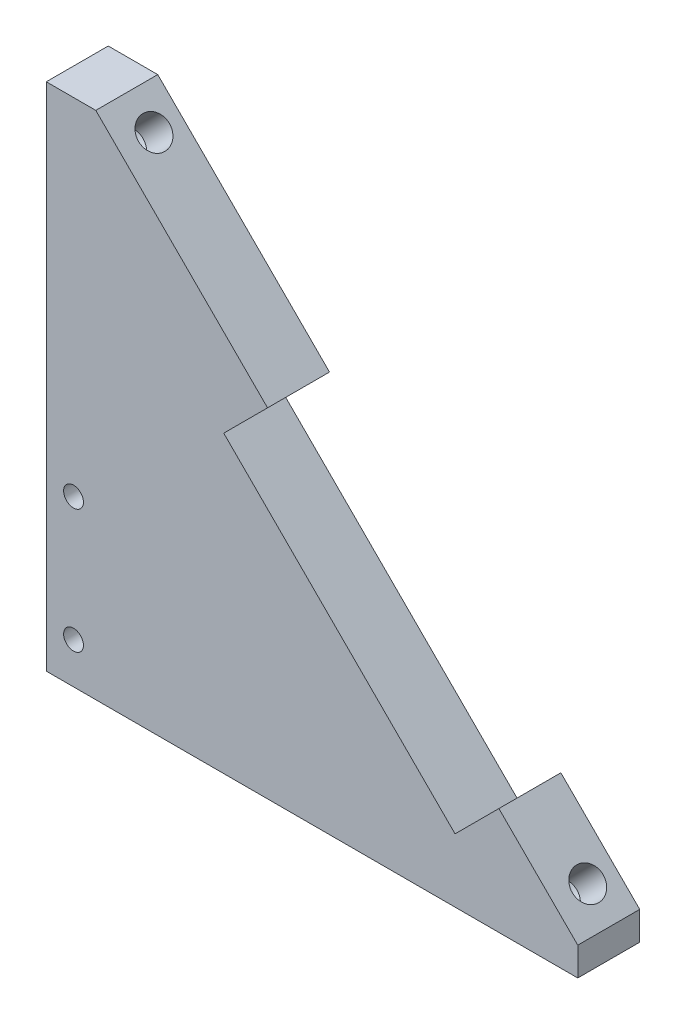
ISO-10303-21;
HEADER;
FILE_DESCRIPTION(('STEP AP214'),'2;1');
FILE_NAME('part.step','',(''),(''),'','','');
FILE_SCHEMA(('AUTOMOTIVE_DESIGN { 1 0 10303 214 1 1 1 1 }'));
ENDSEC;
DATA;
#1=APPLICATION_CONTEXT('core data for automotive mechanical design processes');
#2=APPLICATION_PROTOCOL_DEFINITION('international standard','automotive_design',2000,#1);
#3=PRODUCT_CONTEXT('',#1,'mechanical');
#4=PRODUCT('Part','Part','',(#3));
#5=PRODUCT_RELATED_PRODUCT_CATEGORY('part','',(#4));
#6=PRODUCT_DEFINITION_FORMATION('','',#4);
#7=PRODUCT_DEFINITION_CONTEXT('part definition',#1,'design');
#8=PRODUCT_DEFINITION('design','',#6,#7);
#9=PRODUCT_DEFINITION_SHAPE('','',#8);
#10=(LENGTH_UNIT() NAMED_UNIT(*) SI_UNIT(.MILLI.,.METRE.));
#11=(NAMED_UNIT(*) PLANE_ANGLE_UNIT() SI_UNIT($,.RADIAN.));
#12=(NAMED_UNIT(*) SI_UNIT($,.STERADIAN.) SOLID_ANGLE_UNIT());
#13=UNCERTAINTY_MEASURE_WITH_UNIT(LENGTH_MEASURE(1.E-05),#10,'distance_accuracy_value','');
#14=(GEOMETRIC_REPRESENTATION_CONTEXT(3) GLOBAL_UNCERTAINTY_ASSIGNED_CONTEXT((#13)) GLOBAL_UNIT_ASSIGNED_CONTEXT((#10,
#11,#12)) REPRESENTATION_CONTEXT('',''));
#15=CARTESIAN_POINT('',(0.,0.,0.));
#16=DIRECTION('',(0.,0.,1.));
#17=DIRECTION('',(1.,0.,0.));
#18=AXIS2_PLACEMENT_3D('',#15,#16,#17);
#19=CARTESIAN_POINT('',(-19.44543648263,19.4454364826301,5.));
#20=DIRECTION('',(-0.707106781186549,-0.707106781186546,0.));
#21=DIRECTION('',(0.707106781186546,-0.707106781186549,0.));
#22=AXIS2_PLACEMENT_3D('',#19,#20,#21);
#23=PLANE('',#22);
#24=CARTESIAN_POINT('',(21.0364267402998,-21.0364267402998,2.25));
#25=DIRECTION('',(0.707106781186549,0.707106781186546,0.));
#26=DIRECTION('',(-0.707106781186546,0.707106781186549,0.));
#27=AXIS2_PLACEMENT_3D('',#24,#25,#26);
#28=CIRCLE('',#27,1.24999999999999);
#29=CARTESIAN_POINT('',(20.1525432638166,-20.1525432638166,2.25));
#30=VERTEX_POINT('',#29);
#31=EDGE_CURVE('E217',#30,#30,#28,.T.);
#32=ORIENTED_EDGE('',*,*,#31,.F.);
#33=EDGE_LOOP('',(#32));
#34=FACE_BOUND('',#33,.T.);
#35=DIRECTION('',(-0.707106781186546,0.707106781186549,0.));
#36=VECTOR('',#35,1.);
#37=CARTESIAN_POINT('',(-19.44543648263,19.4454364826301,0.));
#38=LINE('',#37,#36);
#39=CARTESIAN_POINT('',(22.9809703885627,-22.9809703885628,0.));
#40=VERTEX_POINT('',#39);
#41=CARTESIAN_POINT('',(16.6170093578838,-16.6170093578839,0.));
#42=VERTEX_POINT('',#41);
#43=EDGE_CURVE('E45',#40,#42,#38,.T.);
#44=ORIENTED_EDGE('',*,*,#43,.T.);
#45=DIRECTION('',(0.,0.,1.));
#46=VECTOR('',#45,1.);
#47=CARTESIAN_POINT('',(16.6170093578838,-16.6170093578839,0.));
#48=LINE('',#47,#46);
#49=CARTESIAN_POINT('',(16.6170093578838,-16.6170093578839,5.));
#50=VERTEX_POINT('',#49);
#51=EDGE_CURVE('E197',#42,#50,#48,.T.);
#52=ORIENTED_EDGE('',*,*,#51,.T.);
#53=DIRECTION('',(-0.707106781186546,0.707106781186549,0.));
#54=VECTOR('',#53,1.);
#55=CARTESIAN_POINT('',(-19.44543648263,19.4454364826301,5.));
#56=LINE('',#55,#54);
#57=CARTESIAN_POINT('',(22.9809703885627,-22.9809703885628,5.));
#58=VERTEX_POINT('',#57);
#59=EDGE_CURVE('E11',#58,#50,#56,.T.);
#60=ORIENTED_EDGE('',*,*,#59,.F.);
#61=DIRECTION('',(0.,0.,1.));
#62=VECTOR('',#61,1.);
#63=CARTESIAN_POINT('',(22.9809703885627,-22.9809703885628,0.));
#64=LINE('',#63,#62);
#65=EDGE_CURVE('E200',#40,#58,#64,.T.);
#66=ORIENTED_EDGE('',*,*,#65,.F.);
#67=EDGE_LOOP('',(#44,#52,#60,#66));
#68=FACE_BOUND('',#67,.T.);
#69=ADVANCED_FACE('F41',(#34,#68),#23,.F.);
#70=CARTESIAN_POINT('',(-13.9653589284343,13.9653589284343,2.25));
#71=DIRECTION('',(0.707106781186549,0.707106781186546,0.));
#72=DIRECTION('',(-0.707106781186546,0.707106781186549,0.));
#73=AXIS2_PLACEMENT_3D('',#70,#71,#72);
#74=CIRCLE('',#73,1.24999999999999);
#75=CARTESIAN_POINT('',(-14.8492424049175,14.8492424049175,2.25));
#76=VERTEX_POINT('',#75);
#77=EDGE_CURVE('E211',#76,#76,#74,.T.);
#78=ORIENTED_EDGE('',*,*,#77,.F.);
#79=EDGE_LOOP('',(#78));
#80=FACE_BOUND('',#79,.T.);
#81=CARTESIAN_POINT('',(-2.05060966544103,2.05060966544095,5.));
#82=VERTEX_POINT('',#81);
#83=CARTESIAN_POINT('',(-15.9099025766974,15.9099025766973,5.));
#84=VERTEX_POINT('',#83);
#85=EDGE_CURVE('E50',#82,#84,#56,.T.);
#86=ORIENTED_EDGE('',*,*,#85,.F.);
#87=DIRECTION('',(0.,0.,1.));
#88=VECTOR('',#87,1.);
#89=CARTESIAN_POINT('',(-2.05060966544103,2.05060966544095,0.));
#90=LINE('',#89,#88);
#91=CARTESIAN_POINT('',(-2.05060966544103,2.05060966544095,0.));
#92=VERTEX_POINT('',#91);
#93=EDGE_CURVE('E190',#92,#82,#90,.T.);
#94=ORIENTED_EDGE('',*,*,#93,.F.);
#95=CARTESIAN_POINT('',(-15.9099025766973,15.9099025766973,0.));
#96=VERTEX_POINT('',#95);
#97=EDGE_CURVE('E222',#92,#96,#38,.T.);
#98=ORIENTED_EDGE('',*,*,#97,.T.);
#99=DIRECTION('',(0.,0.,1.));
#100=VECTOR('',#99,1.);
#101=CARTESIAN_POINT('',(-15.9099025766974,15.9099025766973,0.));
#102=LINE('',#101,#100);
#103=EDGE_CURVE('E208',#96,#84,#102,.T.);
#104=ORIENTED_EDGE('',*,*,#103,.T.);
#105=EDGE_LOOP('',(#86,#94,#98,#104));
#106=FACE_BOUND('',#105,.T.);
#107=ADVANCED_FACE('F43',(#80,#106),#23,.F.);
#108=CARTESIAN_POINT('',(0.,0.,5.));
#109=DIRECTION('',(0.,0.,-1.));
#110=DIRECTION('',(-1.,0.,0.));
#111=AXIS2_PLACEMENT_3D('',#108,#109,#110);
#112=PLANE('',#111);
#113=CARTESIAN_POINT('',(-17.7061985203111,-11.9765042944956,5.));
#114=DIRECTION('',(0.,0.,-1.));
#115=DIRECTION('',(-1.,0.,0.));
#116=AXIS2_PLACEMENT_3D('',#113,#114,#115);
#117=CIRCLE('',#116,0.799999999999999);
#118=CARTESIAN_POINT('',(-18.5061985203111,-11.9765042944956,5.));
#119=VERTEX_POINT('',#118);
#120=EDGE_CURVE('E155',#119,#119,#117,.T.);
#121=ORIENTED_EDGE('',*,*,#120,.T.);
#122=EDGE_LOOP('',(#121));
#123=FACE_BOUND('',#122,.T.);
#124=CARTESIAN_POINT('',(-17.7061985203111,-21.9765042944956,5.));
#125=DIRECTION('',(0.,0.,-1.));
#126=DIRECTION('',(-1.,0.,0.));
#127=AXIS2_PLACEMENT_3D('',#124,#125,#126);
#128=CIRCLE('',#127,0.799999999999999);
#129=CARTESIAN_POINT('',(-18.5061985203111,-21.9765042944956,5.));
#130=VERTEX_POINT('',#129);
#131=EDGE_CURVE('E161',#130,#130,#128,.T.);
#132=ORIENTED_EDGE('',*,*,#131,.T.);
#133=EDGE_LOOP('',(#132));
#134=FACE_BOUND('',#133,.T.);
#135=DIRECTION('',(0.,1.,0.));
#136=VECTOR('',#135,1.);
#137=CARTESIAN_POINT('',(-19.90543648263,15.9099025766973,5.));
#138=LINE('',#137,#136);
#139=CARTESIAN_POINT('',(-19.90543648263,-25.2765042944956,5.));
#140=VERTEX_POINT('',#139);
#141=CARTESIAN_POINT('',(-19.90543648263,15.9099025766973,5.));
#142=VERTEX_POINT('',#141);
#143=EDGE_CURVE('E165',#140,#142,#138,.T.);
#144=ORIENTED_EDGE('',*,*,#143,.F.);
#145=DIRECTION('',(-1.,0.,0.));
#146=VECTOR('',#145,1.);
#147=CARTESIAN_POINT('',(22.9809703885627,-25.2765042944956,5.));
#148=LINE('',#147,#146);
#149=CARTESIAN_POINT('',(22.9809703885627,-25.2765042944956,5.));
#150=VERTEX_POINT('',#149);
#151=EDGE_CURVE('E57',#150,#140,#148,.T.);
#152=ORIENTED_EDGE('',*,*,#151,.F.);
#153=DIRECTION('',(0.,1.,0.));
#154=VECTOR('',#153,1.);
#155=CARTESIAN_POINT('',(22.9809703885627,-22.9809703885628,5.));
#156=LINE('',#155,#154);
#157=EDGE_CURVE('E175',#150,#58,#156,.T.);
#158=ORIENTED_EDGE('',*,*,#157,.T.);
#159=ORIENTED_EDGE('',*,*,#59,.T.);
#160=DIRECTION('',(0.707106781186548,0.707106781186547,0.));
#161=VECTOR('',#160,1.);
#162=CARTESIAN_POINT('',(13.0814754519511,-20.1525432638166,5.));
#163=LINE('',#162,#161);
#164=CARTESIAN_POINT('',(13.0814754519511,-20.1525432638166,5.));
#165=VERTEX_POINT('',#164);
#166=EDGE_CURVE('E185',#165,#50,#163,.T.);
#167=ORIENTED_EDGE('',*,*,#166,.F.);
#168=DIRECTION('',(0.707106781186548,-0.707106781186547,0.));
#169=VECTOR('',#168,1.);
#170=CARTESIAN_POINT('',(-5.58614357137376,-1.48492424049178,5.));
#171=LINE('',#170,#169);
#172=CARTESIAN_POINT('',(-5.58614357137376,-1.48492424049178,5.));
#173=VERTEX_POINT('',#172);
#174=EDGE_CURVE('E193',#173,#165,#171,.T.);
#175=ORIENTED_EDGE('',*,*,#174,.F.);
#176=DIRECTION('',(-0.707106781186548,-0.707106781186548,0.));
#177=VECTOR('',#176,1.);
#178=CARTESIAN_POINT('',(-2.05060966544103,2.05060966544095,5.));
#179=LINE('',#178,#177);
#180=EDGE_CURVE('E180',#82,#173,#179,.T.);
#181=ORIENTED_EDGE('',*,*,#180,.F.);
#182=ORIENTED_EDGE('',*,*,#85,.T.);
#183=DIRECTION('',(-1.,0.,0.));
#184=VECTOR('',#183,1.);
#185=CARTESIAN_POINT('',(-19.44543648263,15.9099025766973,5.));
#186=LINE('',#185,#184);
#187=EDGE_CURVE('E171',#84,#142,#186,.T.);
#188=ORIENTED_EDGE('',*,*,#187,.T.);
#189=EDGE_LOOP('',(#144,#152,#158,#159,#167,#175,#181,#182,#188));
#190=FACE_BOUND('',#189,.T.);
#191=ADVANCED_FACE('F238',(#123,#134,#190),#112,.F.);
#192=CARTESIAN_POINT('',(0.,0.,0.));
#193=DIRECTION('',(0.,0.,-1.));
#194=DIRECTION('',(-1.,0.,0.));
#195=AXIS2_PLACEMENT_3D('',#192,#193,#194);
#196=PLANE('',#195);
#197=DIRECTION('',(-1.,0.,0.));
#198=VECTOR('',#197,1.);
#199=CARTESIAN_POINT('',(22.9809703885627,-25.2765042944956,0.));
#200=LINE('',#199,#198);
#201=CARTESIAN_POINT('',(22.9809703885627,-25.2765042944956,0.));
#202=VERTEX_POINT('',#201);
#203=CARTESIAN_POINT('',(-19.90543648263,-25.2765042944956,0.));
#204=VERTEX_POINT('',#203);
#205=EDGE_CURVE('E144',#202,#204,#200,.T.);
#206=ORIENTED_EDGE('',*,*,#205,.T.);
#207=DIRECTION('',(0.,1.,0.));
#208=VECTOR('',#207,1.);
#209=CARTESIAN_POINT('',(-19.90543648263,15.9099025766973,0.));
#210=LINE('',#209,#208);
#211=CARTESIAN_POINT('',(-19.90543648263,15.9099025766973,0.));
#212=VERTEX_POINT('',#211);
#213=EDGE_CURVE('E164',#204,#212,#210,.T.);
#214=ORIENTED_EDGE('',*,*,#213,.T.);
#215=DIRECTION('',(-1.,0.,0.));
#216=VECTOR('',#215,1.);
#217=CARTESIAN_POINT('',(-19.44543648263,15.9099025766973,0.));
#218=LINE('',#217,#216);
#219=EDGE_CURVE('E172',#96,#212,#218,.T.);
#220=ORIENTED_EDGE('',*,*,#219,.F.);
#221=ORIENTED_EDGE('',*,*,#97,.F.);
#222=DIRECTION('',(-0.707106781186548,-0.707106781186548,0.));
#223=VECTOR('',#222,1.);
#224=CARTESIAN_POINT('',(-2.05060966544103,2.05060966544095,0.));
#225=LINE('',#224,#223);
#226=CARTESIAN_POINT('',(-5.58614357137376,-1.48492424049178,0.));
#227=VERTEX_POINT('',#226);
#228=EDGE_CURVE('E182',#92,#227,#225,.T.);
#229=ORIENTED_EDGE('',*,*,#228,.T.);
#230=DIRECTION('',(0.707106781186548,-0.707106781186547,0.));
#231=VECTOR('',#230,1.);
#232=CARTESIAN_POINT('',(-5.58614357137376,-1.48492424049178,0.));
#233=LINE('',#232,#231);
#234=CARTESIAN_POINT('',(13.0814754519511,-20.1525432638166,0.));
#235=VERTEX_POINT('',#234);
#236=EDGE_CURVE('E65',#227,#235,#233,.T.);
#237=ORIENTED_EDGE('',*,*,#236,.T.);
#238=DIRECTION('',(0.707106781186548,0.707106781186547,0.));
#239=VECTOR('',#238,1.);
#240=CARTESIAN_POINT('',(13.0814754519511,-20.1525432638166,0.));
#241=LINE('',#240,#239);
#242=EDGE_CURVE('E187',#235,#42,#241,.T.);
#243=ORIENTED_EDGE('',*,*,#242,.T.);
#244=ORIENTED_EDGE('',*,*,#43,.F.);
#245=DIRECTION('',(0.,1.,0.));
#246=VECTOR('',#245,1.);
#247=CARTESIAN_POINT('',(22.9809703885627,-22.9809703885628,0.));
#248=LINE('',#247,#246);
#249=EDGE_CURVE('E178',#202,#40,#248,.T.);
#250=ORIENTED_EDGE('',*,*,#249,.F.);
#251=EDGE_LOOP('',(#206,#214,#220,#221,#229,#237,#243,#244,#250));
#252=FACE_BOUND('',#251,.T.);
#253=CARTESIAN_POINT('',(-17.7061985203111,-11.9765042944956,0.));
#254=DIRECTION('',(0.,0.,-1.));
#255=DIRECTION('',(-1.,0.,0.));
#256=AXIS2_PLACEMENT_3D('',#253,#254,#255);
#257=CIRCLE('',#256,0.799999999999999);
#258=CARTESIAN_POINT('',(-18.5061985203111,-11.9765042944956,0.));
#259=VERTEX_POINT('',#258);
#260=EDGE_CURVE('E151',#259,#259,#257,.T.);
#261=ORIENTED_EDGE('',*,*,#260,.F.);
#262=EDGE_LOOP('',(#261));
#263=FACE_BOUND('',#262,.T.);
#264=CARTESIAN_POINT('',(-17.7061985203111,-21.9765042944956,0.));
#265=DIRECTION('',(0.,0.,-1.));
#266=DIRECTION('',(-1.,0.,0.));
#267=AXIS2_PLACEMENT_3D('',#264,#265,#266);
#268=CIRCLE('',#267,0.799999999999999);
#269=CARTESIAN_POINT('',(-18.5061985203111,-21.9765042944956,0.));
#270=VERTEX_POINT('',#269);
#271=EDGE_CURVE('E158',#270,#270,#268,.T.);
#272=ORIENTED_EDGE('',*,*,#271,.F.);
#273=EDGE_LOOP('',(#272));
#274=FACE_BOUND('',#273,.T.);
#275=ADVANCED_FACE('F245',(#252,#263,#274),#196,.T.);
#276=CARTESIAN_POINT('',(18.9151063967401,-23.1577470838595,2.25));
#277=DIRECTION('',(0.707106781186549,0.707106781186546,0.));
#278=DIRECTION('',(-0.707106781186546,0.707106781186549,0.));
#279=AXIS2_PLACEMENT_3D('',#276,#277,#278);
#280=CONICAL_SURFACE('',#279,1.25,1.02974425867665);
#281=CARTESIAN_POINT('',(18.3840156239122,-23.6888378566874,2.25));
#282=VERTEX_POINT('',#281);
#283=VERTEX_LOOP('',#282);
#284=FACE_BOUND('',#283,.T.);
#285=CARTESIAN_POINT('',(18.9151063967401,-23.1577470838595,2.25));
#286=DIRECTION('',(0.707106781186549,0.707106781186546,0.));
#287=DIRECTION('',(-0.707106781186546,0.707106781186549,0.));
#288=AXIS2_PLACEMENT_3D('',#285,#286,#287);
#289=CIRCLE('',#288,1.25);
#290=CARTESIAN_POINT('',(18.0312229202569,-22.2738636073763,2.25));
#291=VERTEX_POINT('',#290);
#292=EDGE_CURVE('E220',#291,#291,#289,.T.);
#293=ORIENTED_EDGE('',*,*,#292,.T.);
#294=EDGE_LOOP('',(#293));
#295=FACE_BOUND('',#294,.T.);
#296=ADVANCED_FACE('F283',(#284,#295),#280,.F.);
#297=CARTESIAN_POINT('',(21.0364267402998,-21.0364267402998,2.25));
#298=DIRECTION('',(0.707106781186549,0.707106781186546,0.));
#299=DIRECTION('',(-0.707106781186546,0.707106781186549,0.));
#300=AXIS2_PLACEMENT_3D('',#297,#298,#299);
#301=CYLINDRICAL_SURFACE('',#300,1.24999999999999);
#302=ORIENTED_EDGE('',*,*,#292,.F.);
#303=EDGE_LOOP('',(#302));
#304=FACE_BOUND('',#303,.T.);
#305=ORIENTED_EDGE('',*,*,#31,.T.);
#306=EDGE_LOOP('',(#305));
#307=FACE_BOUND('',#306,.T.);
#308=ADVANCED_FACE('F280',(#304,#307),#301,.F.);
#309=CARTESIAN_POINT('',(-16.0866792719939,11.8440385848747,2.25));
#310=DIRECTION('',(0.707106781186549,0.707106781186546,0.));
#311=DIRECTION('',(-0.707106781186546,0.707106781186549,0.));
#312=AXIS2_PLACEMENT_3D('',#309,#310,#311);
#313=CONICAL_SURFACE('',#312,1.25,1.02974425867665);
#314=CARTESIAN_POINT('',(-16.6177700448219,11.3129478120468,2.25));
#315=VERTEX_POINT('',#314);
#316=VERTEX_LOOP('',#315);
#317=FACE_BOUND('',#316,.T.);
#318=CARTESIAN_POINT('',(-16.0866792719939,11.8440385848747,2.25));
#319=DIRECTION('',(0.707106781186549,0.707106781186546,0.));
#320=DIRECTION('',(-0.707106781186546,0.707106781186549,0.));
#321=AXIS2_PLACEMENT_3D('',#318,#319,#320);
#322=CIRCLE('',#321,1.25);
#323=CARTESIAN_POINT('',(-16.9705627484771,12.7279220613579,2.25));
#324=VERTEX_POINT('',#323);
#325=EDGE_CURVE('E214',#324,#324,#322,.T.);
#326=ORIENTED_EDGE('',*,*,#325,.T.);
#327=EDGE_LOOP('',(#326));
#328=FACE_BOUND('',#327,.T.);
#329=ADVANCED_FACE('F282',(#317,#328),#313,.F.);
#330=CARTESIAN_POINT('',(-13.9653589284343,13.9653589284343,2.25));
#331=DIRECTION('',(0.707106781186549,0.707106781186546,0.));
#332=DIRECTION('',(-0.707106781186546,0.707106781186549,0.));
#333=AXIS2_PLACEMENT_3D('',#330,#331,#332);
#334=CYLINDRICAL_SURFACE('',#333,1.24999999999999);
#335=ORIENTED_EDGE('',*,*,#325,.F.);
#336=EDGE_LOOP('',(#335));
#337=FACE_BOUND('',#336,.T.);
#338=ORIENTED_EDGE('',*,*,#77,.T.);
#339=EDGE_LOOP('',(#338));
#340=FACE_BOUND('',#339,.T.);
#341=ADVANCED_FACE('F290',(#337,#340),#334,.F.);
#342=CARTESIAN_POINT('',(13.0814754519511,-20.1525432638166,0.));
#343=DIRECTION('',(0.707106781186547,-0.707106781186548,0.));
#344=DIRECTION('',(0.707106781186548,0.707106781186547,0.));
#345=AXIS2_PLACEMENT_3D('',#342,#343,#344);
#346=PLANE('',#345);
#347=ORIENTED_EDGE('',*,*,#166,.T.);
#348=ORIENTED_EDGE('',*,*,#51,.F.);
#349=ORIENTED_EDGE('',*,*,#242,.F.);
#350=DIRECTION('',(0.,0.,1.));
#351=VECTOR('',#350,1.);
#352=CARTESIAN_POINT('',(13.0814754519511,-20.1525432638166,0.));
#353=LINE('',#352,#351);
#354=EDGE_CURVE('E201',#235,#165,#353,.T.);
#355=ORIENTED_EDGE('',*,*,#354,.T.);
#356=EDGE_LOOP('',(#347,#348,#349,#355));
#357=FACE_BOUND('',#356,.T.);
#358=ADVANCED_FACE('F258',(#357),#346,.F.);
#359=CARTESIAN_POINT('',(-5.58614357137376,-1.48492424049178,0.));
#360=DIRECTION('',(-0.707106781186547,-0.707106781186548,0.));
#361=DIRECTION('',(0.707106781186548,-0.707106781186547,0.));
#362=AXIS2_PLACEMENT_3D('',#359,#360,#361);
#363=PLANE('',#362);
#364=ORIENTED_EDGE('',*,*,#174,.T.);
#365=ORIENTED_EDGE('',*,*,#354,.F.);
#366=ORIENTED_EDGE('',*,*,#236,.F.);
#367=DIRECTION('',(0.,0.,1.));
#368=VECTOR('',#367,1.);
#369=CARTESIAN_POINT('',(-5.58614357137376,-1.48492424049178,0.));
#370=LINE('',#369,#368);
#371=EDGE_CURVE('E203',#227,#173,#370,.T.);
#372=ORIENTED_EDGE('',*,*,#371,.T.);
#373=EDGE_LOOP('',(#364,#365,#366,#372));
#374=FACE_BOUND('',#373,.T.);
#375=ADVANCED_FACE('F260',(#374),#363,.F.);
#376=CARTESIAN_POINT('',(-2.05060966544103,2.05060966544095,0.));
#377=DIRECTION('',(-0.707106781186548,0.707106781186548,0.));
#378=DIRECTION('',(-0.707106781186548,-0.707106781186548,0.));
#379=AXIS2_PLACEMENT_3D('',#376,#377,#378);
#380=PLANE('',#379);
#381=ORIENTED_EDGE('',*,*,#180,.T.);
#382=ORIENTED_EDGE('',*,*,#371,.F.);
#383=ORIENTED_EDGE('',*,*,#228,.F.);
#384=ORIENTED_EDGE('',*,*,#93,.T.);
#385=EDGE_LOOP('',(#381,#382,#383,#384));
#386=FACE_BOUND('',#385,.T.);
#387=ADVANCED_FACE('F262',(#386),#380,.F.);
#388=CARTESIAN_POINT('',(22.9809703885627,-22.9809703885628,0.));
#389=DIRECTION('',(1.,0.,0.));
#390=DIRECTION('',(0.,0.,-1.));
#391=AXIS2_PLACEMENT_3D('',#388,#389,#390);
#392=PLANE('',#391);
#393=DIRECTION('',(0.,0.,1.));
#394=VECTOR('',#393,1.);
#395=CARTESIAN_POINT('',(22.9809703885627,-25.2765042944956,0.));
#396=LINE('',#395,#394);
#397=EDGE_CURVE('E147',#202,#150,#396,.T.);
#398=ORIENTED_EDGE('',*,*,#397,.F.);
#399=ORIENTED_EDGE('',*,*,#249,.T.);
#400=ORIENTED_EDGE('',*,*,#65,.T.);
#401=ORIENTED_EDGE('',*,*,#157,.F.);
#402=EDGE_LOOP('',(#398,#399,#400,#401));
#403=FACE_BOUND('',#402,.T.);
#404=ADVANCED_FACE('F255',(#403),#392,.T.);
#405=CARTESIAN_POINT('',(-19.44543648263,15.9099025766973,0.));
#406=DIRECTION('',(0.,1.,0.));
#407=DIRECTION('',(0.,0.,1.));
#408=AXIS2_PLACEMENT_3D('',#405,#406,#407);
#409=PLANE('',#408);
#410=ORIENTED_EDGE('',*,*,#187,.F.);
#411=ORIENTED_EDGE('',*,*,#103,.F.);
#412=ORIENTED_EDGE('',*,*,#219,.T.);
#413=DIRECTION('',(0.,0.,-1.));
#414=VECTOR('',#413,1.);
#415=CARTESIAN_POINT('',(-19.90543648263,15.9099025766973,5.));
#416=LINE('',#415,#414);
#417=EDGE_CURVE('E167',#142,#212,#416,.T.);
#418=ORIENTED_EDGE('',*,*,#417,.F.);
#419=EDGE_LOOP('',(#410,#411,#412,#418));
#420=FACE_BOUND('',#419,.T.);
#421=ADVANCED_FACE('F243',(#420),#409,.T.);
#422=CARTESIAN_POINT('',(-19.90543648263,15.9099025766973,5.));
#423=DIRECTION('',(-1.,0.,0.));
#424=DIRECTION('',(0.,-1.,0.));
#425=AXIS2_PLACEMENT_3D('',#422,#423,#424);
#426=PLANE('',#425);
#427=DIRECTION('',(0.,0.,1.));
#428=VECTOR('',#427,1.);
#429=CARTESIAN_POINT('',(-19.90543648263,-25.2765042944956,0.));
#430=LINE('',#429,#428);
#431=EDGE_CURVE('E149',#204,#140,#430,.T.);
#432=ORIENTED_EDGE('',*,*,#431,.T.);
#433=ORIENTED_EDGE('',*,*,#143,.T.);
#434=ORIENTED_EDGE('',*,*,#417,.T.);
#435=ORIENTED_EDGE('',*,*,#213,.F.);
#436=EDGE_LOOP('',(#432,#433,#434,#435));
#437=FACE_BOUND('',#436,.T.);
#438=ADVANCED_FACE('F250',(#437),#426,.T.);
#439=CARTESIAN_POINT('',(-17.7061985203111,-21.9765042944956,0.));
#440=DIRECTION('',(0.,0.,-1.));
#441=DIRECTION('',(-1.,0.,0.));
#442=AXIS2_PLACEMENT_3D('',#439,#440,#441);
#443=CYLINDRICAL_SURFACE('',#442,0.799999999999999);
#444=ORIENTED_EDGE('',*,*,#271,.T.);
#445=EDGE_LOOP('',(#444));
#446=FACE_BOUND('',#445,.T.);
#447=ORIENTED_EDGE('',*,*,#131,.F.);
#448=EDGE_LOOP('',(#447));
#449=FACE_BOUND('',#448,.T.);
#450=ADVANCED_FACE('F379',(#446,#449),#443,.F.);
#451=CARTESIAN_POINT('',(-17.7061985203111,-11.9765042944956,0.));
#452=DIRECTION('',(0.,0.,-1.));
#453=DIRECTION('',(-1.,0.,0.));
#454=AXIS2_PLACEMENT_3D('',#451,#452,#453);
#455=CYLINDRICAL_SURFACE('',#454,0.799999999999999);
#456=ORIENTED_EDGE('',*,*,#260,.T.);
#457=EDGE_LOOP('',(#456));
#458=FACE_BOUND('',#457,.T.);
#459=ORIENTED_EDGE('',*,*,#120,.F.);
#460=EDGE_LOOP('',(#459));
#461=FACE_BOUND('',#460,.T.);
#462=ADVANCED_FACE('F385',(#458,#461),#455,.F.);
#463=CARTESIAN_POINT('',(22.9809703885627,-25.2765042944956,0.));
#464=DIRECTION('',(0.,1.,0.));
#465=DIRECTION('',(-1.,0.,0.));
#466=AXIS2_PLACEMENT_3D('',#463,#464,#465);
#467=PLANE('',#466);
#468=CARTESIAN_POINT('',(-7.90543648263004,-25.2765042944956,2.5));
#469=DIRECTION('',(0.,-1.,0.));
#470=DIRECTION('',(0.,0.,-1.));
#471=AXIS2_PLACEMENT_3D('',#468,#469,#470);
#472=CIRCLE('',#471,1.24999999999999);
#473=CARTESIAN_POINT('',(-7.90543648263004,-25.2765042944956,1.25000000000001));
#474=VERTEX_POINT('',#473);
#475=EDGE_CURVE('E134',#474,#474,#472,.T.);
#476=ORIENTED_EDGE('',*,*,#475,.F.);
#477=EDGE_LOOP('',(#476));
#478=FACE_BOUND('',#477,.T.);
#479=CARTESIAN_POINT('',(7.09456351736997,-25.2765042944956,2.5));
#480=DIRECTION('',(0.,-1.,0.));
#481=DIRECTION('',(0.,0.,-1.));
#482=AXIS2_PLACEMENT_3D('',#479,#480,#481);
#483=CIRCLE('',#482,1.24999999999999);
#484=CARTESIAN_POINT('',(7.09456351736997,-25.2765042944956,1.25000000000001));
#485=VERTEX_POINT('',#484);
#486=EDGE_CURVE('E133',#485,#485,#483,.T.);
#487=ORIENTED_EDGE('',*,*,#486,.F.);
#488=EDGE_LOOP('',(#487));
#489=FACE_BOUND('',#488,.T.);
#490=ORIENTED_EDGE('',*,*,#151,.T.);
#491=ORIENTED_EDGE('',*,*,#431,.F.);
#492=ORIENTED_EDGE('',*,*,#205,.F.);
#493=ORIENTED_EDGE('',*,*,#397,.T.);
#494=EDGE_LOOP('',(#490,#491,#492,#493));
#495=FACE_BOUND('',#494,.T.);
#496=ADVANCED_FACE('F396',(#478,#489,#495),#467,.F.);
#497=CARTESIAN_POINT('',(7.09456351736997,-19.2765042944956,2.5));
#498=DIRECTION('',(0.,-1.,0.));
#499=DIRECTION('',(0.,0.,-1.));
#500=AXIS2_PLACEMENT_3D('',#497,#498,#499);
#501=CONICAL_SURFACE('',#500,1.25,1.02974425867665);
#502=CARTESIAN_POINT('',(7.09456351736996,-18.5254285207111,2.5));
#503=VERTEX_POINT('',#502);
#504=VERTEX_LOOP('',#503);
#505=FACE_BOUND('',#504,.T.);
#506=CARTESIAN_POINT('',(7.09456351736997,-19.2765042944956,2.5));
#507=DIRECTION('',(0.,-1.,0.));
#508=DIRECTION('',(0.,0.,-1.));
#509=AXIS2_PLACEMENT_3D('',#506,#507,#508);
#510=CIRCLE('',#509,1.25);
#511=CARTESIAN_POINT('',(7.09456351736997,-19.2765042944956,1.25));
#512=VERTEX_POINT('',#511);
#513=EDGE_CURVE('E137',#512,#512,#510,.T.);
#514=ORIENTED_EDGE('',*,*,#513,.T.);
#515=EDGE_LOOP('',(#514));
#516=FACE_BOUND('',#515,.T.);
#517=ADVANCED_FACE('F461',(#505,#516),#501,.F.);
#518=CARTESIAN_POINT('',(7.09456351736997,-25.2765042944956,2.5));
#519=DIRECTION('',(0.,-1.,0.));
#520=DIRECTION('',(0.,0.,-1.));
#521=AXIS2_PLACEMENT_3D('',#518,#519,#520);
#522=CYLINDRICAL_SURFACE('',#521,1.24999999999999);
#523=ORIENTED_EDGE('',*,*,#513,.F.);
#524=EDGE_LOOP('',(#523));
#525=FACE_BOUND('',#524,.T.);
#526=ORIENTED_EDGE('',*,*,#486,.T.);
#527=EDGE_LOOP('',(#526));
#528=FACE_BOUND('',#527,.T.);
#529=ADVANCED_FACE('F127',(#525,#528),#522,.F.);
#530=CARTESIAN_POINT('',(-7.90543648263004,-19.2765042944956,2.5));
#531=DIRECTION('',(0.,-1.,0.));
#532=DIRECTION('',(0.,0.,-1.));
#533=AXIS2_PLACEMENT_3D('',#530,#531,#532);
#534=CONICAL_SURFACE('',#533,1.25,1.02974425867665);
#535=CARTESIAN_POINT('',(-7.90543648263004,-18.5254285207111,2.5));
#536=VERTEX_POINT('',#535);
#537=VERTEX_LOOP('',#536);
#538=FACE_BOUND('',#537,.T.);
#539=CARTESIAN_POINT('',(-7.90543648263004,-19.2765042944956,2.5));
#540=DIRECTION('',(0.,-1.,0.));
#541=DIRECTION('',(0.,0.,-1.));
#542=AXIS2_PLACEMENT_3D('',#539,#540,#541);
#543=CIRCLE('',#542,1.25);
#544=CARTESIAN_POINT('',(-7.90543648263004,-19.2765042944956,1.25));
#545=VERTEX_POINT('',#544);
#546=EDGE_CURVE('E131',#545,#545,#543,.T.);
#547=ORIENTED_EDGE('',*,*,#546,.T.);
#548=EDGE_LOOP('',(#547));
#549=FACE_BOUND('',#548,.T.);
#550=ADVANCED_FACE('F123',(#538,#549),#534,.F.);
#551=CARTESIAN_POINT('',(-7.90543648263004,-25.2765042944956,2.5));
#552=DIRECTION('',(0.,-1.,0.));
#553=DIRECTION('',(0.,0.,-1.));
#554=AXIS2_PLACEMENT_3D('',#551,#552,#553);
#555=CYLINDRICAL_SURFACE('',#554,1.24999999999999);
#556=ORIENTED_EDGE('',*,*,#546,.F.);
#557=EDGE_LOOP('',(#556));
#558=FACE_BOUND('',#557,.T.);
#559=ORIENTED_EDGE('',*,*,#475,.T.);
#560=EDGE_LOOP('',(#559));
#561=FACE_BOUND('',#560,.T.);
#562=ADVANCED_FACE('F126',(#558,#561),#555,.F.);
#563=CLOSED_SHELL('',(#69,#107,#191,#275,#296,#308,#329,#341,#358,#375,#387,#404,#421,#438,#450,
#462,#496,#517,#529,#550,#562));
#564=MANIFOLD_SOLID_BREP('B2',#563);
#565=ADVANCED_BREP_SHAPE_REPRESENTATION('',(#18,#564),#14);
#566=SHAPE_DEFINITION_REPRESENTATION(#9,#565);
ENDSEC;
END-ISO-10303-21;
